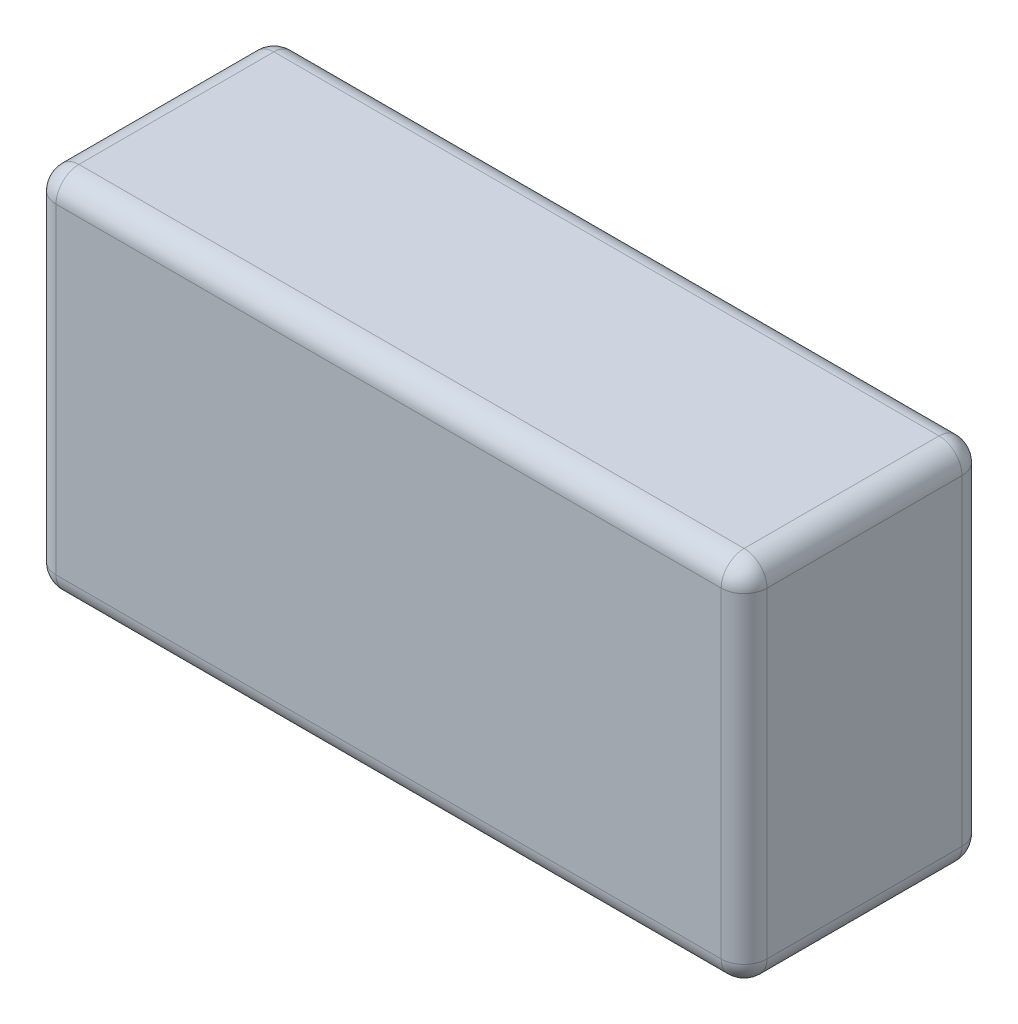
ISO-10303-21;
HEADER;
FILE_DESCRIPTION(('STEP AP214'),'2;1');
FILE_NAME('part.step','',(''),(''),'','','');
FILE_SCHEMA(('AUTOMOTIVE_DESIGN { 1 0 10303 214 1 1 1 1 }'));
ENDSEC;
DATA;
#1=APPLICATION_CONTEXT('core data for automotive mechanical design processes');
#2=APPLICATION_PROTOCOL_DEFINITION('international standard','automotive_design',2000,#1);
#3=PRODUCT_CONTEXT('',#1,'mechanical');
#4=PRODUCT('Part','Part','',(#3));
#5=PRODUCT_RELATED_PRODUCT_CATEGORY('part','',(#4));
#6=PRODUCT_DEFINITION_FORMATION('','',#4);
#7=PRODUCT_DEFINITION_CONTEXT('part definition',#1,'design');
#8=PRODUCT_DEFINITION('design','',#6,#7);
#9=PRODUCT_DEFINITION_SHAPE('','',#8);
#10=(LENGTH_UNIT() NAMED_UNIT(*) SI_UNIT(.MILLI.,.METRE.));
#11=(NAMED_UNIT(*) PLANE_ANGLE_UNIT() SI_UNIT($,.RADIAN.));
#12=(NAMED_UNIT(*) SI_UNIT($,.STERADIAN.) SOLID_ANGLE_UNIT());
#13=UNCERTAINTY_MEASURE_WITH_UNIT(LENGTH_MEASURE(1.E-05),#10,'distance_accuracy_value','');
#14=(GEOMETRIC_REPRESENTATION_CONTEXT(3) GLOBAL_UNCERTAINTY_ASSIGNED_CONTEXT((#13)) GLOBAL_UNIT_ASSIGNED_CONTEXT((#10,
#11,#12)) REPRESENTATION_CONTEXT('',''));
#15=CARTESIAN_POINT('',(0.,0.,0.));
#16=DIRECTION('',(0.,0.,1.));
#17=DIRECTION('',(1.,0.,0.));
#18=AXIS2_PLACEMENT_3D('',#15,#16,#17);
#19=CARTESIAN_POINT('',(-24.9146514935989,10.8036984352774,21.));
#20=DIRECTION('',(1.,0.,0.));
#21=DIRECTION('',(0.,0.,-1.));
#22=AXIS2_PLACEMENT_3D('',#19,#20,#21);
#23=PLANE('',#22);
#24=DIRECTION('',(0.,-1.,0.));
#25=VECTOR('',#24,1.);
#26=CARTESIAN_POINT('',(-24.9146514935989,10.8036984352774,2.));
#27=LINE('',#26,#25);
#28=CARTESIAN_POINT('',(-24.9146514935989,8.80369843527738,2.));
#29=VERTEX_POINT('',#28);
#30=CARTESIAN_POINT('',(-24.9146514935989,-19.1963015647226,2.));
#31=VERTEX_POINT('',#30);
#32=EDGE_CURVE('E179',#29,#31,#27,.T.);
#33=ORIENTED_EDGE('',*,*,#32,.T.);
#34=DIRECTION('',(0.,0.,-1.));
#35=VECTOR('',#34,1.);
#36=CARTESIAN_POINT('',(-24.9146514935989,-19.1963015647226,21.));
#37=LINE('',#36,#35);
#38=CARTESIAN_POINT('',(-24.9146514935989,-19.1963015647226,19.));
#39=VERTEX_POINT('',#38);
#40=EDGE_CURVE('E184',#31,#39,#37,.F.);
#41=ORIENTED_EDGE('',*,*,#40,.T.);
#42=DIRECTION('',(0.,-1.,0.));
#43=VECTOR('',#42,1.);
#44=CARTESIAN_POINT('',(-24.9146514935989,10.8036984352774,19.));
#45=LINE('',#44,#43);
#46=CARTESIAN_POINT('',(-24.9146514935989,8.80369843527738,19.));
#47=VERTEX_POINT('',#46);
#48=EDGE_CURVE('E181',#39,#47,#45,.F.);
#49=ORIENTED_EDGE('',*,*,#48,.T.);
#50=DIRECTION('',(0.,0.,-1.));
#51=VECTOR('',#50,1.);
#52=CARTESIAN_POINT('',(-24.9146514935989,8.80369843527738,21.));
#53=LINE('',#52,#51);
#54=EDGE_CURVE('E177',#47,#29,#53,.T.);
#55=ORIENTED_EDGE('',*,*,#54,.T.);
#56=EDGE_LOOP('',(#33,#41,#49,#55));
#57=FACE_BOUND('',#56,.T.);
#58=ADVANCED_FACE('F34',(#57),#23,.F.);
#59=CARTESIAN_POINT('',(-24.9146514935989,-21.1963015647226,21.));
#60=DIRECTION('',(0.,1.,0.));
#61=DIRECTION('',(0.,0.,1.));
#62=AXIS2_PLACEMENT_3D('',#59,#60,#61);
#63=PLANE('',#62);
#64=DIRECTION('',(1.,0.,0.));
#65=VECTOR('',#64,1.);
#66=CARTESIAN_POINT('',(-24.9146514935989,-21.1963015647226,19.));
#67=LINE('',#66,#65);
#68=CARTESIAN_POINT('',(35.0853485064011,-21.1963015647226,19.));
#69=VERTEX_POINT('',#68);
#70=CARTESIAN_POINT('',(-22.9146514935989,-21.1963015647226,19.));
#71=VERTEX_POINT('',#70);
#72=EDGE_CURVE('E190',#69,#71,#67,.F.);
#73=ORIENTED_EDGE('',*,*,#72,.T.);
#74=DIRECTION('',(0.,0.,-1.));
#75=VECTOR('',#74,1.);
#76=CARTESIAN_POINT('',(-22.9146514935989,-21.1963015647226,21.));
#77=LINE('',#76,#75);
#78=CARTESIAN_POINT('',(-22.9146514935989,-21.1963015647226,2.));
#79=VERTEX_POINT('',#78);
#80=EDGE_CURVE('E192',#71,#79,#77,.T.);
#81=ORIENTED_EDGE('',*,*,#80,.T.);
#82=DIRECTION('',(1.,0.,0.));
#83=VECTOR('',#82,1.);
#84=CARTESIAN_POINT('',(-24.9146514935989,-21.1963015647226,2.));
#85=LINE('',#84,#83);
#86=CARTESIAN_POINT('',(35.0853485064011,-21.1963015647226,2.));
#87=VERTEX_POINT('',#86);
#88=EDGE_CURVE('E186',#79,#87,#85,.T.);
#89=ORIENTED_EDGE('',*,*,#88,.T.);
#90=DIRECTION('',(0.,0.,-1.));
#91=VECTOR('',#90,1.);
#92=CARTESIAN_POINT('',(35.0853485064011,-21.1963015647226,21.));
#93=LINE('',#92,#91);
#94=EDGE_CURVE('E188',#87,#69,#93,.F.);
#95=ORIENTED_EDGE('',*,*,#94,.T.);
#96=EDGE_LOOP('',(#73,#81,#89,#95));
#97=FACE_BOUND('',#96,.T.);
#98=ADVANCED_FACE('F270',(#97),#63,.F.);
#99=CARTESIAN_POINT('',(37.0853485064011,10.8036984352774,21.));
#100=DIRECTION('',(-1.,0.,0.));
#101=DIRECTION('',(0.,-1.,0.));
#102=AXIS2_PLACEMENT_3D('',#99,#100,#101);
#103=PLANE('',#102);
#104=DIRECTION('',(0.,1.,0.));
#105=VECTOR('',#104,1.);
#106=CARTESIAN_POINT('',(37.0853485064011,-21.1963015647226,19.));
#107=LINE('',#106,#105);
#108=CARTESIAN_POINT('',(37.0853485064011,8.80369843527738,19.));
#109=VERTEX_POINT('',#108);
#110=CARTESIAN_POINT('',(37.0853485064011,-19.1963015647226,19.));
#111=VERTEX_POINT('',#110);
#112=EDGE_CURVE('E130',#109,#111,#107,.F.);
#113=ORIENTED_EDGE('',*,*,#112,.T.);
#114=DIRECTION('',(0.,0.,-1.));
#115=VECTOR('',#114,1.);
#116=CARTESIAN_POINT('',(37.0853485064011,-19.1963015647226,21.));
#117=LINE('',#116,#115);
#118=CARTESIAN_POINT('',(37.0853485064011,-19.1963015647226,2.));
#119=VERTEX_POINT('',#118);
#120=EDGE_CURVE('E166',#111,#119,#117,.T.);
#121=ORIENTED_EDGE('',*,*,#120,.T.);
#122=DIRECTION('',(0.,1.,0.));
#123=VECTOR('',#122,1.);
#124=CARTESIAN_POINT('',(37.0853485064011,10.8036984352774,2.));
#125=LINE('',#124,#123);
#126=CARTESIAN_POINT('',(37.0853485064011,8.80369843527738,2.));
#127=VERTEX_POINT('',#126);
#128=EDGE_CURVE('E163',#119,#127,#125,.T.);
#129=ORIENTED_EDGE('',*,*,#128,.T.);
#130=DIRECTION('',(0.,0.,-1.));
#131=VECTOR('',#130,1.);
#132=CARTESIAN_POINT('',(37.0853485064011,8.80369843527738,21.));
#133=LINE('',#132,#131);
#134=EDGE_CURVE('E158',#127,#109,#133,.F.);
#135=ORIENTED_EDGE('',*,*,#134,.T.);
#136=EDGE_LOOP('',(#113,#121,#129,#135));
#137=FACE_BOUND('',#136,.T.);
#138=ADVANCED_FACE('F292',(#137),#103,.F.);
#139=CARTESIAN_POINT('',(-24.9146514935989,10.8036984352774,21.));
#140=DIRECTION('',(0.,-1.,0.));
#141=DIRECTION('',(0.,0.,-1.));
#142=AXIS2_PLACEMENT_3D('',#139,#140,#141);
#143=PLANE('',#142);
#144=DIRECTION('',(-1.,0.,0.));
#145=VECTOR('',#144,1.);
#146=CARTESIAN_POINT('',(37.0853485064011,10.8036984352774,19.));
#147=LINE('',#146,#145);
#148=CARTESIAN_POINT('',(-22.9146514935989,10.8036984352774,19.));
#149=VERTEX_POINT('',#148);
#150=CARTESIAN_POINT('',(35.0853485064011,10.8036984352774,19.));
#151=VERTEX_POINT('',#150);
#152=EDGE_CURVE('E43',#149,#151,#147,.F.);
#153=ORIENTED_EDGE('',*,*,#152,.T.);
#154=DIRECTION('',(0.,0.,-1.));
#155=VECTOR('',#154,1.);
#156=CARTESIAN_POINT('',(35.0853485064011,10.8036984352774,21.));
#157=LINE('',#156,#155);
#158=CARTESIAN_POINT('',(35.0853485064011,10.8036984352774,2.));
#159=VERTEX_POINT('',#158);
#160=EDGE_CURVE('E11',#151,#159,#157,.T.);
#161=ORIENTED_EDGE('',*,*,#160,.T.);
#162=DIRECTION('',(-1.,0.,0.));
#163=VECTOR('',#162,1.);
#164=CARTESIAN_POINT('',(-24.9146514935989,10.8036984352774,2.));
#165=LINE('',#164,#163);
#166=CARTESIAN_POINT('',(-22.9146514935989,10.8036984352774,2.));
#167=VERTEX_POINT('',#166);
#168=EDGE_CURVE('E195',#159,#167,#165,.T.);
#169=ORIENTED_EDGE('',*,*,#168,.T.);
#170=DIRECTION('',(0.,0.,-1.));
#171=VECTOR('',#170,1.);
#172=CARTESIAN_POINT('',(-22.9146514935989,10.8036984352774,21.));
#173=LINE('',#172,#171);
#174=EDGE_CURVE('E54',#167,#149,#173,.F.);
#175=ORIENTED_EDGE('',*,*,#174,.T.);
#176=EDGE_LOOP('',(#153,#161,#169,#175));
#177=FACE_BOUND('',#176,.T.);
#178=ADVANCED_FACE('F298',(#177),#143,.F.);
#179=CARTESIAN_POINT('',(0.,0.,21.));
#180=DIRECTION('',(0.,0.,1.));
#181=DIRECTION('',(1.,0.,0.));
#182=AXIS2_PLACEMENT_3D('',#179,#180,#181);
#183=PLANE('',#182);
#184=DIRECTION('',(0.,-1.,0.));
#185=VECTOR('',#184,1.);
#186=CARTESIAN_POINT('',(-22.9146514935989,-21.1963015647226,21.));
#187=LINE('',#186,#185);
#188=CARTESIAN_POINT('',(-22.9146514935989,8.80369843527738,21.));
#189=VERTEX_POINT('',#188);
#190=CARTESIAN_POINT('',(-22.9146514935989,-19.1963015647226,21.));
#191=VERTEX_POINT('',#190);
#192=EDGE_CURVE('E151',#189,#191,#187,.T.);
#193=ORIENTED_EDGE('',*,*,#192,.T.);
#194=DIRECTION('',(1.,0.,0.));
#195=VECTOR('',#194,1.);
#196=CARTESIAN_POINT('',(37.0853485064011,-19.1963015647226,21.));
#197=LINE('',#196,#195);
#198=CARTESIAN_POINT('',(35.0853485064011,-19.1963015647226,21.));
#199=VERTEX_POINT('',#198);
#200=EDGE_CURVE('E155',#191,#199,#197,.T.);
#201=ORIENTED_EDGE('',*,*,#200,.T.);
#202=DIRECTION('',(0.,1.,0.));
#203=VECTOR('',#202,1.);
#204=CARTESIAN_POINT('',(35.0853485064011,10.8036984352774,21.));
#205=LINE('',#204,#203);
#206=CARTESIAN_POINT('',(35.0853485064011,8.80369843527738,21.));
#207=VERTEX_POINT('',#206);
#208=EDGE_CURVE('E128',#199,#207,#205,.T.);
#209=ORIENTED_EDGE('',*,*,#208,.T.);
#210=DIRECTION('',(-1.,0.,0.));
#211=VECTOR('',#210,1.);
#212=CARTESIAN_POINT('',(-24.9146514935989,8.80369843527738,21.));
#213=LINE('',#212,#211);
#214=EDGE_CURVE('E145',#207,#189,#213,.T.);
#215=ORIENTED_EDGE('',*,*,#214,.T.);
#216=EDGE_LOOP('',(#193,#201,#209,#215));
#217=FACE_BOUND('',#216,.T.);
#218=ADVANCED_FACE('F153',(#217),#183,.T.);
#219=CARTESIAN_POINT('',(0.,0.,0.));
#220=DIRECTION('',(0.,0.,1.));
#221=DIRECTION('',(1.,0.,0.));
#222=AXIS2_PLACEMENT_3D('',#219,#220,#221);
#223=PLANE('',#222);
#224=DIRECTION('',(0.,1.,0.));
#225=VECTOR('',#224,1.);
#226=CARTESIAN_POINT('',(35.0853485064011,0.,0.));
#227=LINE('',#226,#225);
#228=CARTESIAN_POINT('',(35.0853485064011,8.80369843527738,0.));
#229=VERTEX_POINT('',#228);
#230=CARTESIAN_POINT('',(35.0853485064011,-19.1963015647226,0.));
#231=VERTEX_POINT('',#230);
#232=EDGE_CURVE('E172',#229,#231,#227,.F.);
#233=ORIENTED_EDGE('',*,*,#232,.T.);
#234=DIRECTION('',(1.,0.,0.));
#235=VECTOR('',#234,1.);
#236=CARTESIAN_POINT('',(0.,-19.1963015647226,0.));
#237=LINE('',#236,#235);
#238=CARTESIAN_POINT('',(-22.9146514935989,-19.1963015647226,0.));
#239=VERTEX_POINT('',#238);
#240=EDGE_CURVE('E175',#231,#239,#237,.F.);
#241=ORIENTED_EDGE('',*,*,#240,.T.);
#242=DIRECTION('',(0.,-1.,0.));
#243=VECTOR('',#242,1.);
#244=CARTESIAN_POINT('',(-22.9146514935989,0.,0.));
#245=LINE('',#244,#243);
#246=CARTESIAN_POINT('',(-22.9146514935989,8.80369843527738,0.));
#247=VERTEX_POINT('',#246);
#248=EDGE_CURVE('E170',#239,#247,#245,.F.);
#249=ORIENTED_EDGE('',*,*,#248,.T.);
#250=DIRECTION('',(-1.,0.,0.));
#251=VECTOR('',#250,1.);
#252=CARTESIAN_POINT('',(0.,8.80369843527738,0.));
#253=LINE('',#252,#251);
#254=EDGE_CURVE('E168',#247,#229,#253,.F.);
#255=ORIENTED_EDGE('',*,*,#254,.T.);
#256=EDGE_LOOP('',(#233,#241,#249,#255));
#257=FACE_BOUND('',#256,.T.);
#258=ADVANCED_FACE('F316',(#257),#223,.F.);
#259=CARTESIAN_POINT('',(-22.9146514935989,10.8036984352774,2.));
#260=DIRECTION('',(0.,-1.,0.));
#261=DIRECTION('',(0.,0.,-1.));
#262=AXIS2_PLACEMENT_3D('',#259,#260,#261);
#263=CYLINDRICAL_SURFACE('',#262,2.);
#264=CARTESIAN_POINT('',(-22.9146514935989,-19.1963015647226,2.));
#265=DIRECTION('',(0.,-1.,0.));
#266=DIRECTION('',(0.,0.,-1.));
#267=AXIS2_PLACEMENT_3D('',#264,#265,#266);
#268=CIRCLE('',#267,2.);
#269=EDGE_CURVE('E38',#31,#239,#268,.T.);
#270=ORIENTED_EDGE('',*,*,#269,.F.);
#271=ORIENTED_EDGE('',*,*,#32,.F.);
#272=CARTESIAN_POINT('',(-22.9146514935989,8.80369843527738,2.));
#273=DIRECTION('',(0.,1.,0.));
#274=DIRECTION('',(0.,0.,1.));
#275=AXIS2_PLACEMENT_3D('',#272,#273,#274);
#276=CIRCLE('',#275,2.);
#277=EDGE_CURVE('E248',#247,#29,#276,.T.);
#278=ORIENTED_EDGE('',*,*,#277,.F.);
#279=ORIENTED_EDGE('',*,*,#248,.F.);
#280=EDGE_LOOP('',(#270,#271,#278,#279));
#281=FACE_BOUND('',#280,.T.);
#282=ADVANCED_FACE('F36',(#281),#263,.T.);
#283=CARTESIAN_POINT('',(-22.9146514935989,-19.1963015647226,2.));
#284=DIRECTION('',(0.,0.,1.));
#285=DIRECTION('',(1.,0.,0.));
#286=AXIS2_PLACEMENT_3D('',#283,#284,#285);
#287=SPHERICAL_SURFACE('',#286,2.);
#288=CARTESIAN_POINT('',(-22.9146514935989,-19.1963015647226,2.));
#289=DIRECTION('',(0.,0.,-1.));
#290=DIRECTION('',(-1.,0.,0.));
#291=AXIS2_PLACEMENT_3D('',#288,#289,#290);
#292=CIRCLE('',#291,2.);
#293=EDGE_CURVE('E243',#31,#79,#292,.F.);
#294=ORIENTED_EDGE('',*,*,#293,.F.);
#295=ORIENTED_EDGE('',*,*,#269,.T.);
#296=CARTESIAN_POINT('',(-22.9146514935989,-19.1963015647226,2.));
#297=DIRECTION('',(-1.,0.,0.));
#298=DIRECTION('',(0.,0.,1.));
#299=AXIS2_PLACEMENT_3D('',#296,#297,#298);
#300=CIRCLE('',#299,2.);
#301=EDGE_CURVE('E246',#79,#239,#300,.F.);
#302=ORIENTED_EDGE('',*,*,#301,.F.);
#303=EDGE_LOOP('',(#294,#295,#302));
#304=FACE_BOUND('',#303,.T.);
#305=ADVANCED_FACE('F259',(#304),#287,.T.);
#306=CARTESIAN_POINT('',(-22.9146514935989,8.80369843527738,2.));
#307=DIRECTION('',(0.,0.,1.));
#308=DIRECTION('',(1.,0.,0.));
#309=AXIS2_PLACEMENT_3D('',#306,#307,#308);
#310=SPHERICAL_SURFACE('',#309,2.);
#311=CARTESIAN_POINT('',(-22.9146514935989,8.80369843527738,2.));
#312=DIRECTION('',(-1.,0.,0.));
#313=DIRECTION('',(0.,0.,1.));
#314=AXIS2_PLACEMENT_3D('',#311,#312,#313);
#315=CIRCLE('',#314,2.);
#316=EDGE_CURVE('E237',#247,#167,#315,.F.);
#317=ORIENTED_EDGE('',*,*,#316,.F.);
#318=ORIENTED_EDGE('',*,*,#277,.T.);
#319=CARTESIAN_POINT('',(-22.9146514935989,8.80369843527738,2.));
#320=DIRECTION('',(0.,0.,-1.));
#321=DIRECTION('',(-1.,0.,0.));
#322=AXIS2_PLACEMENT_3D('',#319,#320,#321);
#323=CIRCLE('',#322,2.);
#324=EDGE_CURVE('E240',#167,#29,#323,.F.);
#325=ORIENTED_EDGE('',*,*,#324,.F.);
#326=EDGE_LOOP('',(#317,#318,#325));
#327=FACE_BOUND('',#326,.T.);
#328=ADVANCED_FACE('F304',(#327),#310,.T.);
#329=CARTESIAN_POINT('',(-24.9146514935989,-19.1963015647226,2.));
#330=DIRECTION('',(1.,0.,0.));
#331=DIRECTION('',(0.,0.,-1.));
#332=AXIS2_PLACEMENT_3D('',#329,#330,#331);
#333=CYLINDRICAL_SURFACE('',#332,2.);
#334=ORIENTED_EDGE('',*,*,#301,.T.);
#335=ORIENTED_EDGE('',*,*,#240,.F.);
#336=CARTESIAN_POINT('',(35.0853485064011,-19.1963015647226,2.));
#337=DIRECTION('',(1.,0.,0.));
#338=DIRECTION('',(0.,0.,-1.));
#339=AXIS2_PLACEMENT_3D('',#336,#337,#338);
#340=CIRCLE('',#339,2.);
#341=EDGE_CURVE('E232',#87,#231,#340,.T.);
#342=ORIENTED_EDGE('',*,*,#341,.F.);
#343=ORIENTED_EDGE('',*,*,#88,.F.);
#344=EDGE_LOOP('',(#334,#335,#342,#343));
#345=FACE_BOUND('',#344,.T.);
#346=ADVANCED_FACE('F266',(#345),#333,.T.);
#347=CARTESIAN_POINT('',(-22.9146514935989,-19.1963015647226,21.));
#348=DIRECTION('',(0.,0.,-1.));
#349=DIRECTION('',(-1.,0.,0.));
#350=AXIS2_PLACEMENT_3D('',#347,#348,#349);
#351=CYLINDRICAL_SURFACE('',#350,2.);
#352=ORIENTED_EDGE('',*,*,#293,.T.);
#353=ORIENTED_EDGE('',*,*,#80,.F.);
#354=CARTESIAN_POINT('',(-22.9146514935989,-19.1963015647226,19.));
#355=DIRECTION('',(0.,0.,1.));
#356=DIRECTION('',(1.,0.,0.));
#357=AXIS2_PLACEMENT_3D('',#354,#355,#356);
#358=CIRCLE('',#357,2.);
#359=EDGE_CURVE('E229',#39,#71,#358,.T.);
#360=ORIENTED_EDGE('',*,*,#359,.F.);
#361=ORIENTED_EDGE('',*,*,#40,.F.);
#362=EDGE_LOOP('',(#352,#353,#360,#361));
#363=FACE_BOUND('',#362,.T.);
#364=ADVANCED_FACE('F276',(#363),#351,.T.);
#365=CARTESIAN_POINT('',(-22.9146514935989,0.,19.));
#366=DIRECTION('',(0.,1.,0.));
#367=DIRECTION('',(0.,0.,1.));
#368=AXIS2_PLACEMENT_3D('',#365,#366,#367);
#369=CYLINDRICAL_SURFACE('',#368,2.);
#370=CARTESIAN_POINT('',(-22.9146514935989,8.80369843527738,19.));
#371=DIRECTION('',(0.,1.,0.));
#372=DIRECTION('',(0.,0.,1.));
#373=AXIS2_PLACEMENT_3D('',#370,#371,#372);
#374=CIRCLE('',#373,2.);
#375=EDGE_CURVE('E223',#47,#189,#374,.T.);
#376=ORIENTED_EDGE('',*,*,#375,.F.);
#377=ORIENTED_EDGE('',*,*,#48,.F.);
#378=CARTESIAN_POINT('',(-22.9146514935989,-19.1963015647226,19.));
#379=DIRECTION('',(0.,-1.,0.));
#380=DIRECTION('',(0.,0.,-1.));
#381=AXIS2_PLACEMENT_3D('',#378,#379,#380);
#382=CIRCLE('',#381,2.);
#383=EDGE_CURVE('E226',#191,#39,#382,.T.);
#384=ORIENTED_EDGE('',*,*,#383,.F.);
#385=ORIENTED_EDGE('',*,*,#192,.F.);
#386=EDGE_LOOP('',(#376,#377,#384,#385));
#387=FACE_BOUND('',#386,.T.);
#388=ADVANCED_FACE('F313',(#387),#369,.T.);
#389=CARTESIAN_POINT('',(-22.9146514935989,8.80369843527738,21.));
#390=DIRECTION('',(0.,0.,-1.));
#391=DIRECTION('',(-1.,0.,0.));
#392=AXIS2_PLACEMENT_3D('',#389,#390,#391);
#393=CYLINDRICAL_SURFACE('',#392,2.);
#394=ORIENTED_EDGE('',*,*,#324,.T.);
#395=ORIENTED_EDGE('',*,*,#54,.F.);
#396=CARTESIAN_POINT('',(-22.9146514935989,8.80369843527738,19.));
#397=DIRECTION('',(0.,0.,1.));
#398=DIRECTION('',(1.,0.,0.));
#399=AXIS2_PLACEMENT_3D('',#396,#397,#398);
#400=CIRCLE('',#399,2.);
#401=EDGE_CURVE('E221',#149,#47,#400,.T.);
#402=ORIENTED_EDGE('',*,*,#401,.F.);
#403=ORIENTED_EDGE('',*,*,#174,.F.);
#404=EDGE_LOOP('',(#394,#395,#402,#403));
#405=FACE_BOUND('',#404,.T.);
#406=ADVANCED_FACE('F307',(#405),#393,.T.);
#407=CARTESIAN_POINT('',(-24.9146514935989,8.80369843527738,2.));
#408=DIRECTION('',(-1.,0.,0.));
#409=DIRECTION('',(0.,0.,1.));
#410=AXIS2_PLACEMENT_3D('',#407,#408,#409);
#411=CYLINDRICAL_SURFACE('',#410,2.);
#412=ORIENTED_EDGE('',*,*,#316,.T.);
#413=ORIENTED_EDGE('',*,*,#168,.F.);
#414=CARTESIAN_POINT('',(35.0853485064011,8.80369843527738,2.));
#415=DIRECTION('',(1.,0.,0.));
#416=DIRECTION('',(0.,1.,0.));
#417=AXIS2_PLACEMENT_3D('',#414,#415,#416);
#418=CIRCLE('',#417,2.);
#419=EDGE_CURVE('E218',#229,#159,#418,.T.);
#420=ORIENTED_EDGE('',*,*,#419,.F.);
#421=ORIENTED_EDGE('',*,*,#254,.F.);
#422=EDGE_LOOP('',(#412,#413,#420,#421));
#423=FACE_BOUND('',#422,.T.);
#424=ADVANCED_FACE('F303',(#423),#411,.T.);
#425=CARTESIAN_POINT('',(35.0853485064011,10.8036984352774,2.));
#426=DIRECTION('',(0.,1.,0.));
#427=DIRECTION('',(-1.,0.,0.));
#428=AXIS2_PLACEMENT_3D('',#425,#426,#427);
#429=CYLINDRICAL_SURFACE('',#428,2.);
#430=CARTESIAN_POINT('',(35.0853485064011,-19.1963015647226,2.));
#431=DIRECTION('',(0.,-1.,0.));
#432=DIRECTION('',(0.,0.,-1.));
#433=AXIS2_PLACEMENT_3D('',#430,#431,#432);
#434=CIRCLE('',#433,2.);
#435=EDGE_CURVE('E234',#231,#119,#434,.T.);
#436=ORIENTED_EDGE('',*,*,#435,.F.);
#437=ORIENTED_EDGE('',*,*,#232,.F.);
#438=CARTESIAN_POINT('',(35.0853485064011,8.80369843527738,2.));
#439=DIRECTION('',(0.,1.,0.));
#440=DIRECTION('',(0.,0.,1.));
#441=AXIS2_PLACEMENT_3D('',#438,#439,#440);
#442=CIRCLE('',#441,2.);
#443=EDGE_CURVE('E215',#127,#229,#442,.T.);
#444=ORIENTED_EDGE('',*,*,#443,.F.);
#445=ORIENTED_EDGE('',*,*,#128,.F.);
#446=EDGE_LOOP('',(#436,#437,#444,#445));
#447=FACE_BOUND('',#446,.T.);
#448=ADVANCED_FACE('F320',(#447),#429,.T.);
#449=CARTESIAN_POINT('',(35.0853485064011,-19.1963015647226,2.));
#450=DIRECTION('',(0.,0.,1.));
#451=DIRECTION('',(1.,0.,0.));
#452=AXIS2_PLACEMENT_3D('',#449,#450,#451);
#453=SPHERICAL_SURFACE('',#452,2.);
#454=ORIENTED_EDGE('',*,*,#341,.T.);
#455=ORIENTED_EDGE('',*,*,#435,.T.);
#456=CARTESIAN_POINT('',(35.0853485064011,-19.1963015647226,2.));
#457=DIRECTION('',(0.,0.,-1.));
#458=DIRECTION('',(-1.,0.,0.));
#459=AXIS2_PLACEMENT_3D('',#456,#457,#458);
#460=CIRCLE('',#459,2.);
#461=EDGE_CURVE('E212',#87,#119,#460,.F.);
#462=ORIENTED_EDGE('',*,*,#461,.F.);
#463=EDGE_LOOP('',(#454,#455,#462));
#464=FACE_BOUND('',#463,.T.);
#465=ADVANCED_FACE('F407',(#464),#453,.T.);
#466=CARTESIAN_POINT('',(-22.9146514935989,-19.1963015647226,19.));
#467=DIRECTION('',(0.,0.,1.));
#468=DIRECTION('',(1.,0.,0.));
#469=AXIS2_PLACEMENT_3D('',#466,#467,#468);
#470=SPHERICAL_SURFACE('',#469,2.);
#471=ORIENTED_EDGE('',*,*,#383,.T.);
#472=ORIENTED_EDGE('',*,*,#359,.T.);
#473=CARTESIAN_POINT('',(-22.9146514935989,-19.1963015647226,19.));
#474=DIRECTION('',(-1.,0.,0.));
#475=DIRECTION('',(0.,0.,1.));
#476=AXIS2_PLACEMENT_3D('',#473,#474,#475);
#477=CIRCLE('',#476,2.);
#478=EDGE_CURVE('E209',#191,#71,#477,.F.);
#479=ORIENTED_EDGE('',*,*,#478,.F.);
#480=EDGE_LOOP('',(#471,#472,#479));
#481=FACE_BOUND('',#480,.T.);
#482=ADVANCED_FACE('F279',(#481),#470,.T.);
#483=CARTESIAN_POINT('',(-22.9146514935989,8.80369843527738,19.));
#484=DIRECTION('',(0.,0.,1.));
#485=DIRECTION('',(1.,0.,0.));
#486=AXIS2_PLACEMENT_3D('',#483,#484,#485);
#487=SPHERICAL_SURFACE('',#486,2.);
#488=ORIENTED_EDGE('',*,*,#401,.T.);
#489=ORIENTED_EDGE('',*,*,#375,.T.);
#490=CARTESIAN_POINT('',(-22.9146514935989,8.80369843527738,19.));
#491=DIRECTION('',(-1.,0.,0.));
#492=DIRECTION('',(0.,0.,1.));
#493=AXIS2_PLACEMENT_3D('',#490,#491,#492);
#494=CIRCLE('',#493,2.);
#495=EDGE_CURVE('E148',#149,#189,#494,.F.);
#496=ORIENTED_EDGE('',*,*,#495,.F.);
#497=EDGE_LOOP('',(#488,#489,#496));
#498=FACE_BOUND('',#497,.T.);
#499=ADVANCED_FACE('F310',(#498),#487,.T.);
#500=CARTESIAN_POINT('',(35.0853485064011,8.80369843527738,2.));
#501=DIRECTION('',(0.,0.,1.));
#502=DIRECTION('',(1.,0.,0.));
#503=AXIS2_PLACEMENT_3D('',#500,#501,#502);
#504=SPHERICAL_SURFACE('',#503,2.);
#505=ORIENTED_EDGE('',*,*,#443,.T.);
#506=ORIENTED_EDGE('',*,*,#419,.T.);
#507=CARTESIAN_POINT('',(35.0853485064011,8.80369843527738,2.));
#508=DIRECTION('',(0.,0.,-1.));
#509=DIRECTION('',(-1.,0.,0.));
#510=AXIS2_PLACEMENT_3D('',#507,#508,#509);
#511=CIRCLE('',#510,2.);
#512=EDGE_CURVE('E206',#127,#159,#511,.F.);
#513=ORIENTED_EDGE('',*,*,#512,.F.);
#514=EDGE_LOOP('',(#505,#506,#513));
#515=FACE_BOUND('',#514,.T.);
#516=ADVANCED_FACE('F322',(#515),#504,.T.);
#517=CARTESIAN_POINT('',(35.0853485064011,-19.1963015647226,21.));
#518=DIRECTION('',(0.,0.,-1.));
#519=DIRECTION('',(-1.,0.,0.));
#520=AXIS2_PLACEMENT_3D('',#517,#518,#519);
#521=CYLINDRICAL_SURFACE('',#520,2.);
#522=ORIENTED_EDGE('',*,*,#461,.T.);
#523=ORIENTED_EDGE('',*,*,#120,.F.);
#524=CARTESIAN_POINT('',(35.0853485064011,-19.1963015647226,19.));
#525=DIRECTION('',(0.,0.,1.));
#526=DIRECTION('',(1.,0.,0.));
#527=AXIS2_PLACEMENT_3D('',#524,#525,#526);
#528=CIRCLE('',#527,2.);
#529=EDGE_CURVE('E203',#69,#111,#528,.T.);
#530=ORIENTED_EDGE('',*,*,#529,.F.);
#531=ORIENTED_EDGE('',*,*,#94,.F.);
#532=EDGE_LOOP('',(#522,#523,#530,#531));
#533=FACE_BOUND('',#532,.T.);
#534=ADVANCED_FACE('F289',(#533),#521,.T.);
#535=CARTESIAN_POINT('',(0.,-19.1963015647226,19.));
#536=DIRECTION('',(-1.,0.,0.));
#537=DIRECTION('',(0.,0.,1.));
#538=AXIS2_PLACEMENT_3D('',#535,#536,#537);
#539=CYLINDRICAL_SURFACE('',#538,2.);
#540=ORIENTED_EDGE('',*,*,#478,.T.);
#541=ORIENTED_EDGE('',*,*,#72,.F.);
#542=CARTESIAN_POINT('',(35.0853485064011,-19.1963015647226,19.));
#543=DIRECTION('',(1.,0.,0.));
#544=DIRECTION('',(0.,0.,-1.));
#545=AXIS2_PLACEMENT_3D('',#542,#543,#544);
#546=CIRCLE('',#545,2.);
#547=EDGE_CURVE('E142',#199,#69,#546,.T.);
#548=ORIENTED_EDGE('',*,*,#547,.F.);
#549=ORIENTED_EDGE('',*,*,#200,.F.);
#550=EDGE_LOOP('',(#540,#541,#548,#549));
#551=FACE_BOUND('',#550,.T.);
#552=ADVANCED_FACE('F282',(#551),#539,.T.);
#553=CARTESIAN_POINT('',(0.,8.80369843527738,19.));
#554=DIRECTION('',(1.,0.,0.));
#555=DIRECTION('',(0.,0.,-1.));
#556=AXIS2_PLACEMENT_3D('',#553,#554,#555);
#557=CYLINDRICAL_SURFACE('',#556,2.);
#558=ORIENTED_EDGE('',*,*,#495,.T.);
#559=ORIENTED_EDGE('',*,*,#214,.F.);
#560=CARTESIAN_POINT('',(35.0853485064011,8.80369843527738,19.));
#561=DIRECTION('',(1.,0.,0.));
#562=DIRECTION('',(0.,0.,-1.));
#563=AXIS2_PLACEMENT_3D('',#560,#561,#562);
#564=CIRCLE('',#563,2.);
#565=EDGE_CURVE('E136',#151,#207,#564,.T.);
#566=ORIENTED_EDGE('',*,*,#565,.F.);
#567=ORIENTED_EDGE('',*,*,#152,.F.);
#568=EDGE_LOOP('',(#558,#559,#566,#567));
#569=FACE_BOUND('',#568,.T.);
#570=ADVANCED_FACE('F146',(#569),#557,.T.);
#571=CARTESIAN_POINT('',(35.0853485064011,8.80369843527738,21.));
#572=DIRECTION('',(0.,0.,-1.));
#573=DIRECTION('',(-1.,0.,0.));
#574=AXIS2_PLACEMENT_3D('',#571,#572,#573);
#575=CYLINDRICAL_SURFACE('',#574,2.);
#576=ORIENTED_EDGE('',*,*,#512,.T.);
#577=ORIENTED_EDGE('',*,*,#160,.F.);
#578=CARTESIAN_POINT('',(35.0853485064011,8.80369843527738,19.));
#579=DIRECTION('',(0.,0.,1.));
#580=DIRECTION('',(1.,0.,0.));
#581=AXIS2_PLACEMENT_3D('',#578,#579,#580);
#582=CIRCLE('',#581,2.);
#583=EDGE_CURVE('E140',#109,#151,#582,.T.);
#584=ORIENTED_EDGE('',*,*,#583,.F.);
#585=ORIENTED_EDGE('',*,*,#134,.F.);
#586=EDGE_LOOP('',(#576,#577,#584,#585));
#587=FACE_BOUND('',#586,.T.);
#588=ADVANCED_FACE('F296',(#587),#575,.T.);
#589=CARTESIAN_POINT('',(35.0853485064011,-19.1963015647226,19.));
#590=DIRECTION('',(0.,0.,1.));
#591=DIRECTION('',(1.,0.,0.));
#592=AXIS2_PLACEMENT_3D('',#589,#590,#591);
#593=SPHERICAL_SURFACE('',#592,2.);
#594=ORIENTED_EDGE('',*,*,#547,.T.);
#595=ORIENTED_EDGE('',*,*,#529,.T.);
#596=CARTESIAN_POINT('',(35.0853485064011,-19.1963015647226,19.));
#597=DIRECTION('',(0.,-1.,0.));
#598=DIRECTION('',(0.,0.,-1.));
#599=AXIS2_PLACEMENT_3D('',#596,#597,#598);
#600=CIRCLE('',#599,2.);
#601=EDGE_CURVE('E133',#199,#111,#600,.F.);
#602=ORIENTED_EDGE('',*,*,#601,.F.);
#603=EDGE_LOOP('',(#594,#595,#602));
#604=FACE_BOUND('',#603,.T.);
#605=ADVANCED_FACE('F286',(#604),#593,.T.);
#606=CARTESIAN_POINT('',(35.0853485064011,8.80369843527738,19.));
#607=DIRECTION('',(0.,0.,1.));
#608=DIRECTION('',(1.,0.,0.));
#609=AXIS2_PLACEMENT_3D('',#606,#607,#608);
#610=SPHERICAL_SURFACE('',#609,2.);
#611=ORIENTED_EDGE('',*,*,#583,.T.);
#612=ORIENTED_EDGE('',*,*,#565,.T.);
#613=CARTESIAN_POINT('',(35.0853485064011,8.80369843527738,19.));
#614=DIRECTION('',(0.,1.,0.));
#615=DIRECTION('',(0.,0.,1.));
#616=AXIS2_PLACEMENT_3D('',#613,#614,#615);
#617=CIRCLE('',#616,2.);
#618=EDGE_CURVE('E124',#109,#207,#617,.F.);
#619=ORIENTED_EDGE('',*,*,#618,.F.);
#620=EDGE_LOOP('',(#611,#612,#619));
#621=FACE_BOUND('',#620,.T.);
#622=ADVANCED_FACE('F138',(#621),#610,.T.);
#623=CARTESIAN_POINT('',(35.0853485064011,0.,19.));
#624=DIRECTION('',(0.,-1.,0.));
#625=DIRECTION('',(1.,0.,0.));
#626=AXIS2_PLACEMENT_3D('',#623,#624,#625);
#627=CYLINDRICAL_SURFACE('',#626,2.);
#628=ORIENTED_EDGE('',*,*,#601,.T.);
#629=ORIENTED_EDGE('',*,*,#112,.F.);
#630=ORIENTED_EDGE('',*,*,#618,.T.);
#631=ORIENTED_EDGE('',*,*,#208,.F.);
#632=EDGE_LOOP('',(#628,#629,#630,#631));
#633=FACE_BOUND('',#632,.T.);
#634=ADVANCED_FACE('F126',(#633),#627,.T.);
#635=CLOSED_SHELL('',(#58,#98,#138,#178,#218,#258,#282,#305,#328,#346,#364,#388,#406,#424,#448,
#465,#482,#499,#516,#534,#552,#570,#588,#605,#622,#634));
#636=MANIFOLD_SOLID_BREP('B2',#635);
#637=ADVANCED_BREP_SHAPE_REPRESENTATION('',(#18,#636),#14);
#638=SHAPE_DEFINITION_REPRESENTATION(#9,#637);
ENDSEC;
END-ISO-10303-21;
